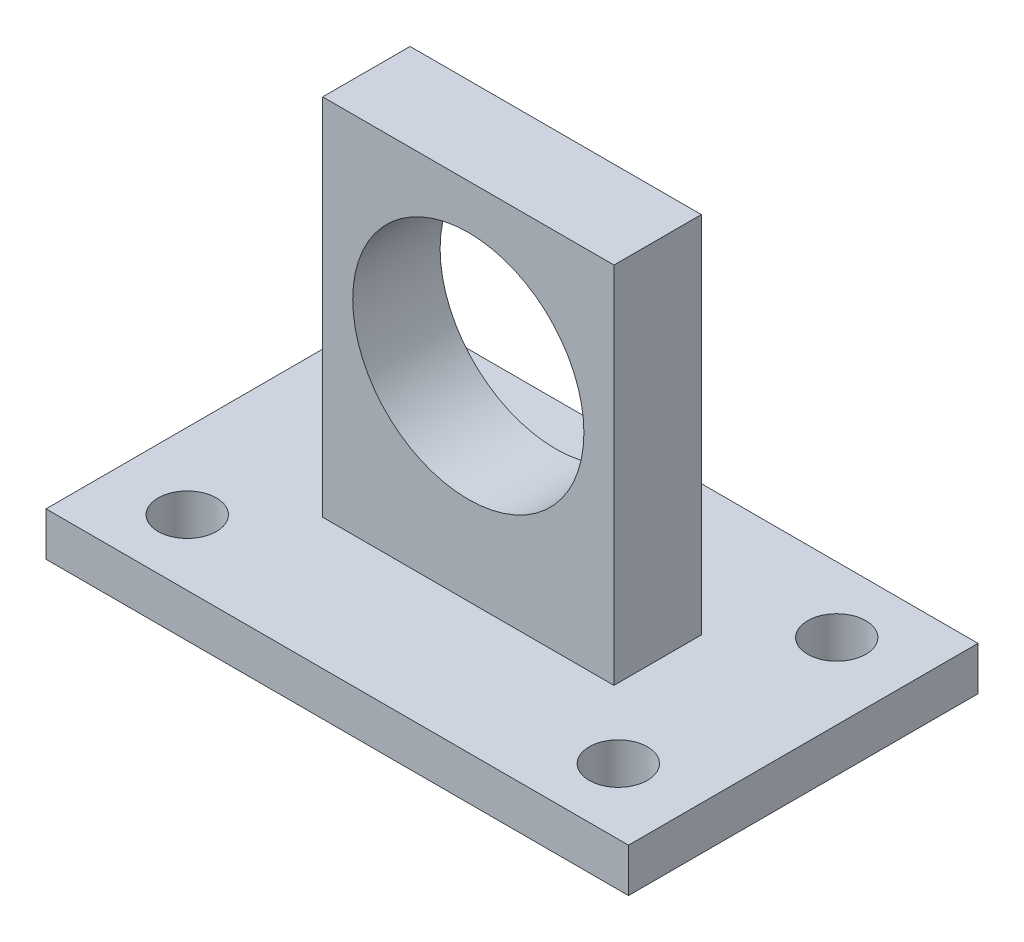
ISO-10303-21;
HEADER;
FILE_DESCRIPTION(('STEP AP214'),'2;1');
FILE_NAME('part.step','',(''),(''),'','','');
FILE_SCHEMA(('AUTOMOTIVE_DESIGN { 1 0 10303 214 1 1 1 1 }'));
ENDSEC;
DATA;
#1=APPLICATION_CONTEXT('core data for automotive mechanical design processes');
#2=APPLICATION_PROTOCOL_DEFINITION('international standard','automotive_design',2000,#1);
#3=PRODUCT_CONTEXT('',#1,'mechanical');
#4=PRODUCT('Part','Part','',(#3));
#5=PRODUCT_RELATED_PRODUCT_CATEGORY('part','',(#4));
#6=PRODUCT_DEFINITION_FORMATION('','',#4);
#7=PRODUCT_DEFINITION_CONTEXT('part definition',#1,'design');
#8=PRODUCT_DEFINITION('design','',#6,#7);
#9=PRODUCT_DEFINITION_SHAPE('','',#8);
#10=(LENGTH_UNIT() NAMED_UNIT(*) SI_UNIT(.MILLI.,.METRE.));
#11=(NAMED_UNIT(*) PLANE_ANGLE_UNIT() SI_UNIT($,.RADIAN.));
#12=(NAMED_UNIT(*) SI_UNIT($,.STERADIAN.) SOLID_ANGLE_UNIT());
#13=UNCERTAINTY_MEASURE_WITH_UNIT(LENGTH_MEASURE(1.E-05),#10,'distance_accuracy_value','');
#14=(GEOMETRIC_REPRESENTATION_CONTEXT(3) GLOBAL_UNCERTAINTY_ASSIGNED_CONTEXT((#13)) GLOBAL_UNIT_ASSIGNED_CONTEXT((#10,
#11,#12)) REPRESENTATION_CONTEXT('',''));
#15=CARTESIAN_POINT('',(0.,0.,0.));
#16=DIRECTION('',(0.,0.,1.));
#17=DIRECTION('',(1.,0.,0.));
#18=AXIS2_PLACEMENT_3D('',#15,#16,#17);
#19=CARTESIAN_POINT('',(0.,3.,0.));
#20=DIRECTION('',(0.,1.,0.));
#21=DIRECTION('',(0.,0.,1.));
#22=AXIS2_PLACEMENT_3D('',#19,#20,#21);
#23=PLANE('',#22);
#24=CARTESIAN_POINT('',(-14.8,3.,-7.5));
#25=DIRECTION('',(0.,1.,0.));
#26=DIRECTION('',(0.,0.,-1.));
#27=AXIS2_PLACEMENT_3D('',#24,#25,#26);
#28=CIRCLE('',#27,2.);
#29=CARTESIAN_POINT('',(-14.8,3.,-9.5));
#30=VERTEX_POINT('',#29);
#31=EDGE_CURVE('E146',#30,#30,#28,.T.);
#32=ORIENTED_EDGE('',*,*,#31,.F.);
#33=EDGE_LOOP('',(#32));
#34=FACE_BOUND('',#33,.T.);
#35=CARTESIAN_POINT('',(-14.8,3.,7.5));
#36=DIRECTION('',(0.,1.,0.));
#37=DIRECTION('',(0.,0.,1.));
#38=AXIS2_PLACEMENT_3D('',#35,#36,#37);
#39=CIRCLE('',#38,2.);
#40=CARTESIAN_POINT('',(-14.8,3.,9.5));
#41=VERTEX_POINT('',#40);
#42=EDGE_CURVE('E158',#41,#41,#39,.T.);
#43=ORIENTED_EDGE('',*,*,#42,.F.);
#44=EDGE_LOOP('',(#43));
#45=FACE_BOUND('',#44,.T.);
#46=DIRECTION('',(0.,0.,-1.));
#47=VECTOR('',#46,1.);
#48=CARTESIAN_POINT('',(20.,3.,-12.));
#49=LINE('',#48,#47);
#50=CARTESIAN_POINT('',(20.,3.,12.));
#51=VERTEX_POINT('',#50);
#52=CARTESIAN_POINT('',(20.,3.,-12.));
#53=VERTEX_POINT('',#52);
#54=EDGE_CURVE('E164',#51,#53,#49,.T.);
#55=ORIENTED_EDGE('',*,*,#54,.T.);
#56=DIRECTION('',(-1.,0.,0.));
#57=VECTOR('',#56,1.);
#58=CARTESIAN_POINT('',(-20.,3.,-12.));
#59=LINE('',#58,#57);
#60=CARTESIAN_POINT('',(-20.,3.,-12.));
#61=VERTEX_POINT('',#60);
#62=EDGE_CURVE('E88',#53,#61,#59,.T.);
#63=ORIENTED_EDGE('',*,*,#62,.T.);
#64=DIRECTION('',(0.,0.,1.));
#65=VECTOR('',#64,1.);
#66=CARTESIAN_POINT('',(-20.,3.,-12.));
#67=LINE('',#66,#65);
#68=CARTESIAN_POINT('',(-20.,3.,12.));
#69=VERTEX_POINT('',#68);
#70=EDGE_CURVE('E167',#61,#69,#67,.T.);
#71=ORIENTED_EDGE('',*,*,#70,.T.);
#72=DIRECTION('',(1.,0.,0.));
#73=VECTOR('',#72,1.);
#74=CARTESIAN_POINT('',(-20.,3.,12.));
#75=LINE('',#74,#73);
#76=EDGE_CURVE('E60',#69,#51,#75,.T.);
#77=ORIENTED_EDGE('',*,*,#76,.T.);
#78=EDGE_LOOP('',(#55,#63,#71,#77));
#79=FACE_BOUND('',#78,.T.);
#80=CARTESIAN_POINT('',(14.8,3.,7.5));
#81=DIRECTION('',(0.,1.,0.));
#82=DIRECTION('',(0.,0.,-1.));
#83=AXIS2_PLACEMENT_3D('',#80,#81,#82);
#84=CIRCLE('',#83,2.);
#85=CARTESIAN_POINT('',(14.8,3.,5.5));
#86=VERTEX_POINT('',#85);
#87=EDGE_CURVE('E152',#86,#86,#84,.T.);
#88=ORIENTED_EDGE('',*,*,#87,.F.);
#89=EDGE_LOOP('',(#88));
#90=FACE_BOUND('',#89,.T.);
#91=CARTESIAN_POINT('',(14.8,3.,-7.5));
#92=DIRECTION('',(0.,1.,0.));
#93=DIRECTION('',(0.,0.,1.));
#94=AXIS2_PLACEMENT_3D('',#91,#92,#93);
#95=CIRCLE('',#94,2.);
#96=CARTESIAN_POINT('',(14.8,3.,-5.5));
#97=VERTEX_POINT('',#96);
#98=EDGE_CURVE('E138',#97,#97,#95,.T.);
#99=ORIENTED_EDGE('',*,*,#98,.F.);
#100=EDGE_LOOP('',(#99));
#101=FACE_BOUND('',#100,.T.);
#102=DIRECTION('',(0.,0.,1.));
#103=VECTOR('',#102,1.);
#104=CARTESIAN_POINT('',(-10.,3.,-3.));
#105=LINE('',#104,#103);
#106=CARTESIAN_POINT('',(-10.,3.,-3.));
#107=VERTEX_POINT('',#106);
#108=CARTESIAN_POINT('',(-10.,3.,3.));
#109=VERTEX_POINT('',#108);
#110=EDGE_CURVE('E254',#107,#109,#105,.T.);
#111=ORIENTED_EDGE('',*,*,#110,.F.);
#112=DIRECTION('',(-1.,0.,0.));
#113=VECTOR('',#112,1.);
#114=CARTESIAN_POINT('',(-10.,3.,-3.));
#115=LINE('',#114,#113);
#116=CARTESIAN_POINT('',(10.,3.,-3.));
#117=VERTEX_POINT('',#116);
#118=EDGE_CURVE('E133',#117,#107,#115,.T.);
#119=ORIENTED_EDGE('',*,*,#118,.F.);
#120=DIRECTION('',(0.,0.,-1.));
#121=VECTOR('',#120,1.);
#122=CARTESIAN_POINT('',(10.,3.,-3.));
#123=LINE('',#122,#121);
#124=CARTESIAN_POINT('',(10.,3.,3.));
#125=VERTEX_POINT('',#124);
#126=EDGE_CURVE('E129',#125,#117,#123,.T.);
#127=ORIENTED_EDGE('',*,*,#126,.F.);
#128=DIRECTION('',(1.,0.,0.));
#129=VECTOR('',#128,1.);
#130=CARTESIAN_POINT('',(-10.,3.,3.));
#131=LINE('',#130,#129);
#132=EDGE_CURVE('E262',#109,#125,#131,.T.);
#133=ORIENTED_EDGE('',*,*,#132,.F.);
#134=EDGE_LOOP('',(#111,#119,#127,#133));
#135=FACE_BOUND('',#134,.T.);
#136=ADVANCED_FACE('F36',(#34,#45,#79,#90,#101,#135),#23,.T.);
#137=CARTESIAN_POINT('',(0.,0.,0.));
#138=DIRECTION('',(0.,1.,0.));
#139=DIRECTION('',(0.,0.,1.));
#140=AXIS2_PLACEMENT_3D('',#137,#138,#139);
#141=PLANE('',#140);
#142=DIRECTION('',(0.,0.,-1.));
#143=VECTOR('',#142,1.);
#144=CARTESIAN_POINT('',(20.,0.,-12.));
#145=LINE('',#144,#143);
#146=CARTESIAN_POINT('',(20.,0.,12.));
#147=VERTEX_POINT('',#146);
#148=CARTESIAN_POINT('',(20.,0.,-12.));
#149=VERTEX_POINT('',#148);
#150=EDGE_CURVE('E161',#147,#149,#145,.T.);
#151=ORIENTED_EDGE('',*,*,#150,.F.);
#152=DIRECTION('',(1.,0.,0.));
#153=VECTOR('',#152,1.);
#154=CARTESIAN_POINT('',(-20.,0.,12.));
#155=LINE('',#154,#153);
#156=CARTESIAN_POINT('',(-20.,0.,12.));
#157=VERTEX_POINT('',#156);
#158=EDGE_CURVE('E81',#157,#147,#155,.T.);
#159=ORIENTED_EDGE('',*,*,#158,.F.);
#160=DIRECTION('',(0.,0.,1.));
#161=VECTOR('',#160,1.);
#162=CARTESIAN_POINT('',(-20.,0.,-12.));
#163=LINE('',#162,#161);
#164=CARTESIAN_POINT('',(-20.,0.,-12.));
#165=VERTEX_POINT('',#164);
#166=EDGE_CURVE('E175',#165,#157,#163,.T.);
#167=ORIENTED_EDGE('',*,*,#166,.F.);
#168=DIRECTION('',(-1.,0.,0.));
#169=VECTOR('',#168,1.);
#170=CARTESIAN_POINT('',(-20.,0.,-12.));
#171=LINE('',#170,#169);
#172=EDGE_CURVE('E173',#149,#165,#171,.T.);
#173=ORIENTED_EDGE('',*,*,#172,.F.);
#174=EDGE_LOOP('',(#151,#159,#167,#173));
#175=FACE_BOUND('',#174,.T.);
#176=CARTESIAN_POINT('',(-14.8,0.,7.5));
#177=DIRECTION('',(0.,1.,0.));
#178=DIRECTION('',(0.,0.,1.));
#179=AXIS2_PLACEMENT_3D('',#176,#177,#178);
#180=CIRCLE('',#179,2.);
#181=CARTESIAN_POINT('',(-14.8,0.,9.5));
#182=VERTEX_POINT('',#181);
#183=EDGE_CURVE('E155',#182,#182,#180,.T.);
#184=ORIENTED_EDGE('',*,*,#183,.T.);
#185=EDGE_LOOP('',(#184));
#186=FACE_BOUND('',#185,.T.);
#187=CARTESIAN_POINT('',(14.8,0.,7.5));
#188=DIRECTION('',(0.,1.,0.));
#189=DIRECTION('',(0.,0.,-1.));
#190=AXIS2_PLACEMENT_3D('',#187,#188,#189);
#191=CIRCLE('',#190,2.);
#192=CARTESIAN_POINT('',(14.8,0.,5.5));
#193=VERTEX_POINT('',#192);
#194=EDGE_CURVE('E149',#193,#193,#191,.T.);
#195=ORIENTED_EDGE('',*,*,#194,.T.);
#196=EDGE_LOOP('',(#195));
#197=FACE_BOUND('',#196,.T.);
#198=CARTESIAN_POINT('',(-14.8,0.,-7.5));
#199=DIRECTION('',(0.,1.,0.));
#200=DIRECTION('',(0.,0.,-1.));
#201=AXIS2_PLACEMENT_3D('',#198,#199,#200);
#202=CIRCLE('',#201,2.);
#203=CARTESIAN_POINT('',(-14.8,0.,-9.5));
#204=VERTEX_POINT('',#203);
#205=EDGE_CURVE('E144',#204,#204,#202,.T.);
#206=ORIENTED_EDGE('',*,*,#205,.T.);
#207=EDGE_LOOP('',(#206));
#208=FACE_BOUND('',#207,.T.);
#209=CARTESIAN_POINT('',(14.8,0.,-7.5));
#210=DIRECTION('',(0.,1.,0.));
#211=DIRECTION('',(0.,0.,1.));
#212=AXIS2_PLACEMENT_3D('',#209,#210,#211);
#213=CIRCLE('',#212,2.);
#214=CARTESIAN_POINT('',(14.8,0.,-5.5));
#215=VERTEX_POINT('',#214);
#216=EDGE_CURVE('E135',#215,#215,#213,.T.);
#217=ORIENTED_EDGE('',*,*,#216,.T.);
#218=EDGE_LOOP('',(#217));
#219=FACE_BOUND('',#218,.T.);
#220=ADVANCED_FACE('F188',(#175,#186,#197,#208,#219),#141,.F.);
#221=CARTESIAN_POINT('',(20.,3.,-12.));
#222=DIRECTION('',(-1.,0.,0.));
#223=DIRECTION('',(0.,0.,1.));
#224=AXIS2_PLACEMENT_3D('',#221,#222,#223);
#225=PLANE('',#224);
#226=ORIENTED_EDGE('',*,*,#150,.T.);
#227=DIRECTION('',(0.,-1.,0.));
#228=VECTOR('',#227,1.);
#229=CARTESIAN_POINT('',(20.,3.,-12.));
#230=LINE('',#229,#228);
#231=EDGE_CURVE('E11',#53,#149,#230,.T.);
#232=ORIENTED_EDGE('',*,*,#231,.F.);
#233=ORIENTED_EDGE('',*,*,#54,.F.);
#234=DIRECTION('',(0.,-1.,0.));
#235=VECTOR('',#234,1.);
#236=CARTESIAN_POINT('',(20.,3.,12.));
#237=LINE('',#236,#235);
#238=EDGE_CURVE('E170',#51,#147,#237,.T.);
#239=ORIENTED_EDGE('',*,*,#238,.T.);
#240=EDGE_LOOP('',(#226,#232,#233,#239));
#241=FACE_BOUND('',#240,.T.);
#242=ADVANCED_FACE('F38',(#241),#225,.F.);
#243=CARTESIAN_POINT('',(-20.,3.,-12.));
#244=DIRECTION('',(0.,0.,1.));
#245=DIRECTION('',(1.,0.,0.));
#246=AXIS2_PLACEMENT_3D('',#243,#244,#245);
#247=PLANE('',#246);
#248=ORIENTED_EDGE('',*,*,#172,.T.);
#249=DIRECTION('',(0.,-1.,0.));
#250=VECTOR('',#249,1.);
#251=CARTESIAN_POINT('',(-20.,3.,-12.));
#252=LINE('',#251,#250);
#253=EDGE_CURVE('E44',#61,#165,#252,.T.);
#254=ORIENTED_EDGE('',*,*,#253,.F.);
#255=ORIENTED_EDGE('',*,*,#62,.F.);
#256=ORIENTED_EDGE('',*,*,#231,.T.);
#257=EDGE_LOOP('',(#248,#254,#255,#256));
#258=FACE_BOUND('',#257,.T.);
#259=ADVANCED_FACE('F204',(#258),#247,.F.);
#260=CARTESIAN_POINT('',(-20.,3.,-12.));
#261=DIRECTION('',(1.,0.,0.));
#262=DIRECTION('',(0.,0.,-1.));
#263=AXIS2_PLACEMENT_3D('',#260,#261,#262);
#264=PLANE('',#263);
#265=ORIENTED_EDGE('',*,*,#166,.T.);
#266=DIRECTION('',(0.,-1.,0.));
#267=VECTOR('',#266,1.);
#268=CARTESIAN_POINT('',(-20.,3.,12.));
#269=LINE('',#268,#267);
#270=EDGE_CURVE('E179',#69,#157,#269,.T.);
#271=ORIENTED_EDGE('',*,*,#270,.F.);
#272=ORIENTED_EDGE('',*,*,#70,.F.);
#273=ORIENTED_EDGE('',*,*,#253,.T.);
#274=EDGE_LOOP('',(#265,#271,#272,#273));
#275=FACE_BOUND('',#274,.T.);
#276=ADVANCED_FACE('F184',(#275),#264,.F.);
#277=CARTESIAN_POINT('',(-20.,3.,12.));
#278=DIRECTION('',(0.,0.,-1.));
#279=DIRECTION('',(-1.,0.,0.));
#280=AXIS2_PLACEMENT_3D('',#277,#278,#279);
#281=PLANE('',#280);
#282=ORIENTED_EDGE('',*,*,#158,.T.);
#283=ORIENTED_EDGE('',*,*,#238,.F.);
#284=ORIENTED_EDGE('',*,*,#76,.F.);
#285=ORIENTED_EDGE('',*,*,#270,.T.);
#286=EDGE_LOOP('',(#282,#283,#284,#285));
#287=FACE_BOUND('',#286,.T.);
#288=ADVANCED_FACE('F193',(#287),#281,.F.);
#289=CARTESIAN_POINT('',(-14.8,3.,7.5));
#290=DIRECTION('',(0.,-1.,0.));
#291=DIRECTION('',(0.,0.,-1.));
#292=AXIS2_PLACEMENT_3D('',#289,#290,#291);
#293=CYLINDRICAL_SURFACE('',#292,2.);
#294=ORIENTED_EDGE('',*,*,#42,.T.);
#295=EDGE_LOOP('',(#294));
#296=FACE_BOUND('',#295,.T.);
#297=ORIENTED_EDGE('',*,*,#183,.F.);
#298=EDGE_LOOP('',(#297));
#299=FACE_BOUND('',#298,.T.);
#300=ADVANCED_FACE('F195',(#296,#299),#293,.F.);
#301=CARTESIAN_POINT('',(14.8,3.,7.5));
#302=DIRECTION('',(0.,-1.,0.));
#303=DIRECTION('',(0.,0.,-1.));
#304=AXIS2_PLACEMENT_3D('',#301,#302,#303);
#305=CYLINDRICAL_SURFACE('',#304,2.);
#306=ORIENTED_EDGE('',*,*,#87,.T.);
#307=EDGE_LOOP('',(#306));
#308=FACE_BOUND('',#307,.T.);
#309=ORIENTED_EDGE('',*,*,#194,.F.);
#310=EDGE_LOOP('',(#309));
#311=FACE_BOUND('',#310,.T.);
#312=ADVANCED_FACE('F201',(#308,#311),#305,.F.);
#313=CARTESIAN_POINT('',(-14.8,3.,-7.5));
#314=DIRECTION('',(0.,-1.,0.));
#315=DIRECTION('',(0.,0.,-1.));
#316=AXIS2_PLACEMENT_3D('',#313,#314,#315);
#317=CYLINDRICAL_SURFACE('',#316,2.);
#318=ORIENTED_EDGE('',*,*,#31,.T.);
#319=EDGE_LOOP('',(#318));
#320=FACE_BOUND('',#319,.T.);
#321=ORIENTED_EDGE('',*,*,#205,.F.);
#322=EDGE_LOOP('',(#321));
#323=FACE_BOUND('',#322,.T.);
#324=ADVANCED_FACE('F218',(#320,#323),#317,.F.);
#325=CARTESIAN_POINT('',(14.8,3.,-7.5));
#326=DIRECTION('',(0.,-1.,0.));
#327=DIRECTION('',(0.,0.,-1.));
#328=AXIS2_PLACEMENT_3D('',#325,#326,#327);
#329=CYLINDRICAL_SURFACE('',#328,2.);
#330=ORIENTED_EDGE('',*,*,#98,.T.);
#331=EDGE_LOOP('',(#330));
#332=FACE_BOUND('',#331,.T.);
#333=ORIENTED_EDGE('',*,*,#216,.F.);
#334=EDGE_LOOP('',(#333));
#335=FACE_BOUND('',#334,.T.);
#336=ADVANCED_FACE('F222',(#332,#335),#329,.F.);
#337=CARTESIAN_POINT('',(-10.,28.,-3.));
#338=DIRECTION('',(0.,0.,1.));
#339=DIRECTION('',(1.,0.,0.));
#340=AXIS2_PLACEMENT_3D('',#337,#338,#339);
#341=PLANE('',#340);
#342=CARTESIAN_POINT('',(0.,17.,-3.));
#343=DIRECTION('',(0.,0.,1.));
#344=DIRECTION('',(1.,0.,0.));
#345=AXIS2_PLACEMENT_3D('',#342,#343,#344);
#346=CIRCLE('',#345,7.9375);
#347=CARTESIAN_POINT('',(7.9375,17.,-3.));
#348=VERTEX_POINT('',#347);
#349=EDGE_CURVE('E252',#348,#348,#346,.T.);
#350=ORIENTED_EDGE('',*,*,#349,.T.);
#351=EDGE_LOOP('',(#350));
#352=FACE_BOUND('',#351,.T.);
#353=ORIENTED_EDGE('',*,*,#118,.T.);
#354=DIRECTION('',(0.,-1.,0.));
#355=VECTOR('',#354,1.);
#356=CARTESIAN_POINT('',(-10.,28.,-3.));
#357=LINE('',#356,#355);
#358=CARTESIAN_POINT('',(-10.,28.,-3.));
#359=VERTEX_POINT('',#358);
#360=EDGE_CURVE('E114',#359,#107,#357,.T.);
#361=ORIENTED_EDGE('',*,*,#360,.F.);
#362=DIRECTION('',(-1.,0.,0.));
#363=VECTOR('',#362,1.);
#364=CARTESIAN_POINT('',(-10.,28.,-3.));
#365=LINE('',#364,#363);
#366=CARTESIAN_POINT('',(10.,28.,-3.));
#367=VERTEX_POINT('',#366);
#368=EDGE_CURVE('E121',#367,#359,#365,.T.);
#369=ORIENTED_EDGE('',*,*,#368,.F.);
#370=DIRECTION('',(0.,-1.,0.));
#371=VECTOR('',#370,1.);
#372=CARTESIAN_POINT('',(10.,28.,-3.));
#373=LINE('',#372,#371);
#374=EDGE_CURVE('E259',#367,#117,#373,.T.);
#375=ORIENTED_EDGE('',*,*,#374,.T.);
#376=EDGE_LOOP('',(#353,#361,#369,#375));
#377=FACE_BOUND('',#376,.T.);
#378=ADVANCED_FACE('F131',(#352,#377),#341,.F.);
#379=CARTESIAN_POINT('',(-10.,28.,-3.));
#380=DIRECTION('',(1.,0.,0.));
#381=DIRECTION('',(0.,0.,-1.));
#382=AXIS2_PLACEMENT_3D('',#379,#380,#381);
#383=PLANE('',#382);
#384=ORIENTED_EDGE('',*,*,#110,.T.);
#385=DIRECTION('',(0.,-1.,0.));
#386=VECTOR('',#385,1.);
#387=CARTESIAN_POINT('',(-10.,28.,3.));
#388=LINE('',#387,#386);
#389=CARTESIAN_POINT('',(-10.,28.,3.));
#390=VERTEX_POINT('',#389);
#391=EDGE_CURVE('E117',#390,#109,#388,.T.);
#392=ORIENTED_EDGE('',*,*,#391,.F.);
#393=DIRECTION('',(0.,0.,1.));
#394=VECTOR('',#393,1.);
#395=CARTESIAN_POINT('',(-10.,28.,-3.));
#396=LINE('',#395,#394);
#397=EDGE_CURVE('E110',#359,#390,#396,.T.);
#398=ORIENTED_EDGE('',*,*,#397,.F.);
#399=ORIENTED_EDGE('',*,*,#360,.T.);
#400=EDGE_LOOP('',(#384,#392,#398,#399));
#401=FACE_BOUND('',#400,.T.);
#402=ADVANCED_FACE('F112',(#401),#383,.F.);
#403=CARTESIAN_POINT('',(-10.,28.,3.));
#404=DIRECTION('',(0.,0.,-1.));
#405=DIRECTION('',(-1.,0.,0.));
#406=AXIS2_PLACEMENT_3D('',#403,#404,#405);
#407=PLANE('',#406);
#408=CARTESIAN_POINT('',(0.,17.,3.));
#409=DIRECTION('',(0.,0.,1.));
#410=DIRECTION('',(1.,0.,0.));
#411=AXIS2_PLACEMENT_3D('',#408,#409,#410);
#412=CIRCLE('',#411,7.9375);
#413=CARTESIAN_POINT('',(7.9375,17.,3.));
#414=VERTEX_POINT('',#413);
#415=EDGE_CURVE('E249',#414,#414,#412,.T.);
#416=ORIENTED_EDGE('',*,*,#415,.F.);
#417=EDGE_LOOP('',(#416));
#418=FACE_BOUND('',#417,.T.);
#419=ORIENTED_EDGE('',*,*,#132,.T.);
#420=DIRECTION('',(0.,-1.,0.));
#421=VECTOR('',#420,1.);
#422=CARTESIAN_POINT('',(10.,28.,3.));
#423=LINE('',#422,#421);
#424=CARTESIAN_POINT('',(10.,28.,3.));
#425=VERTEX_POINT('',#424);
#426=EDGE_CURVE('E51',#425,#125,#423,.T.);
#427=ORIENTED_EDGE('',*,*,#426,.F.);
#428=DIRECTION('',(1.,0.,0.));
#429=VECTOR('',#428,1.);
#430=CARTESIAN_POINT('',(-10.,28.,3.));
#431=LINE('',#430,#429);
#432=EDGE_CURVE('E120',#390,#425,#431,.T.);
#433=ORIENTED_EDGE('',*,*,#432,.F.);
#434=ORIENTED_EDGE('',*,*,#391,.T.);
#435=EDGE_LOOP('',(#419,#427,#433,#434));
#436=FACE_BOUND('',#435,.T.);
#437=ADVANCED_FACE('F232',(#418,#436),#407,.F.);
#438=CARTESIAN_POINT('',(10.,28.,-3.));
#439=DIRECTION('',(-1.,0.,0.));
#440=DIRECTION('',(0.,0.,1.));
#441=AXIS2_PLACEMENT_3D('',#438,#439,#440);
#442=PLANE('',#441);
#443=ORIENTED_EDGE('',*,*,#126,.T.);
#444=ORIENTED_EDGE('',*,*,#374,.F.);
#445=DIRECTION('',(0.,0.,-1.));
#446=VECTOR('',#445,1.);
#447=CARTESIAN_POINT('',(10.,28.,-3.));
#448=LINE('',#447,#446);
#449=EDGE_CURVE('E125',#425,#367,#448,.T.);
#450=ORIENTED_EDGE('',*,*,#449,.F.);
#451=ORIENTED_EDGE('',*,*,#426,.T.);
#452=EDGE_LOOP('',(#443,#444,#450,#451));
#453=FACE_BOUND('',#452,.T.);
#454=ADVANCED_FACE('F235',(#453),#442,.F.);
#455=CARTESIAN_POINT('',(0.,28.,0.));
#456=DIRECTION('',(0.,-1.,0.));
#457=DIRECTION('',(0.,0.,-1.));
#458=AXIS2_PLACEMENT_3D('',#455,#456,#457);
#459=PLANE('',#458);
#460=ORIENTED_EDGE('',*,*,#368,.T.);
#461=ORIENTED_EDGE('',*,*,#397,.T.);
#462=ORIENTED_EDGE('',*,*,#432,.T.);
#463=ORIENTED_EDGE('',*,*,#449,.T.);
#464=EDGE_LOOP('',(#460,#461,#462,#463));
#465=FACE_BOUND('',#464,.T.);
#466=ADVANCED_FACE('F124',(#465),#459,.F.);
#467=CARTESIAN_POINT('',(0.,17.,-7.));
#468=DIRECTION('',(0.,0.,1.));
#469=DIRECTION('',(1.,0.,0.));
#470=AXIS2_PLACEMENT_3D('',#467,#468,#469);
#471=CYLINDRICAL_SURFACE('',#470,7.9375);
#472=ORIENTED_EDGE('',*,*,#415,.T.);
#473=EDGE_LOOP('',(#472));
#474=FACE_BOUND('',#473,.T.);
#475=ORIENTED_EDGE('',*,*,#349,.F.);
#476=EDGE_LOOP('',(#475));
#477=FACE_BOUND('',#476,.T.);
#478=ADVANCED_FACE('F241',(#474,#477),#471,.F.);
#479=CLOSED_SHELL('',(#136,#220,#242,#259,#276,#288,#300,#312,#324,#336,#378,#402,#437,#454,
#466,#478));
#480=MANIFOLD_SOLID_BREP('B2',#479);
#481=ADVANCED_BREP_SHAPE_REPRESENTATION('',(#18,#480),#14);
#482=SHAPE_DEFINITION_REPRESENTATION(#9,#481);
ENDSEC;
END-ISO-10303-21;
